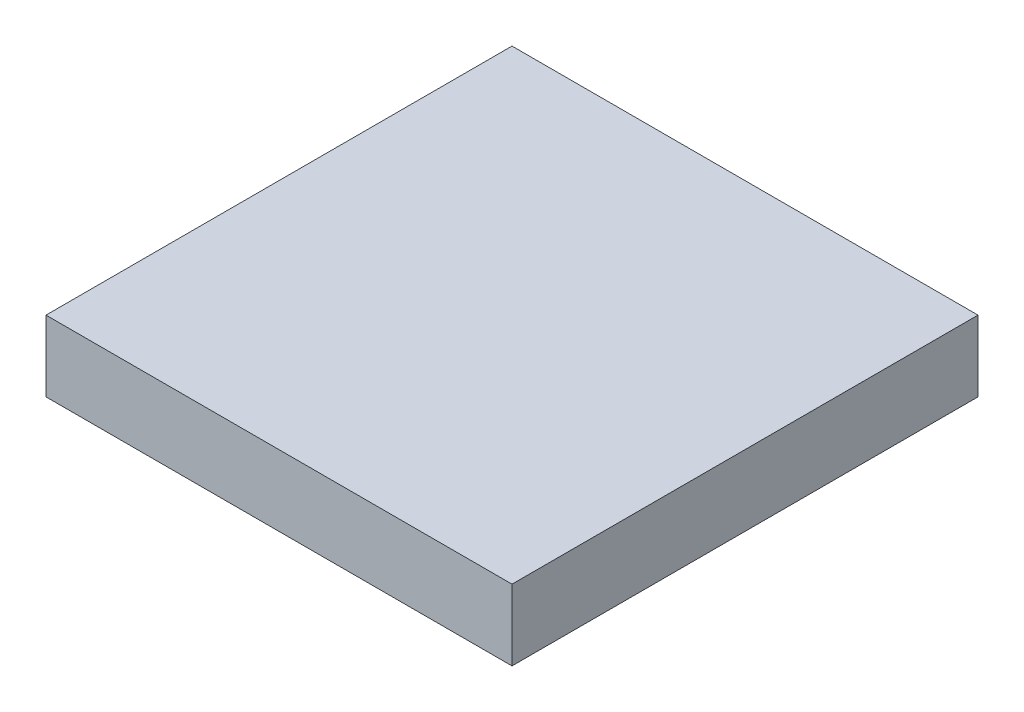
ISO-10303-21;
HEADER;
FILE_DESCRIPTION(('STEP AP214'),'2;1');
FILE_NAME('part.step','',(''),(''),'','','');
FILE_SCHEMA(('AUTOMOTIVE_DESIGN { 1 0 10303 214 1 1 1 1 }'));
ENDSEC;
DATA;
#1=APPLICATION_CONTEXT('core data for automotive mechanical design processes');
#2=APPLICATION_PROTOCOL_DEFINITION('international standard','automotive_design',2000,#1);
#3=PRODUCT_CONTEXT('',#1,'mechanical');
#4=PRODUCT('Part','Part','',(#3));
#5=PRODUCT_RELATED_PRODUCT_CATEGORY('part','',(#4));
#6=PRODUCT_DEFINITION_FORMATION('','',#4);
#7=PRODUCT_DEFINITION_CONTEXT('part definition',#1,'design');
#8=PRODUCT_DEFINITION('design','',#6,#7);
#9=PRODUCT_DEFINITION_SHAPE('','',#8);
#10=(LENGTH_UNIT() NAMED_UNIT(*) SI_UNIT(.MILLI.,.METRE.));
#11=(NAMED_UNIT(*) PLANE_ANGLE_UNIT() SI_UNIT($,.RADIAN.));
#12=(NAMED_UNIT(*) SI_UNIT($,.STERADIAN.) SOLID_ANGLE_UNIT());
#13=UNCERTAINTY_MEASURE_WITH_UNIT(LENGTH_MEASURE(1.E-05),#10,'distance_accuracy_value','');
#14=(GEOMETRIC_REPRESENTATION_CONTEXT(3) GLOBAL_UNCERTAINTY_ASSIGNED_CONTEXT((#13)) GLOBAL_UNIT_ASSIGNED_CONTEXT((#10,
#11,#12)) REPRESENTATION_CONTEXT('',''));
#15=CARTESIAN_POINT('',(0.,0.,0.));
#16=DIRECTION('',(0.,0.,1.));
#17=DIRECTION('',(1.,0.,0.));
#18=AXIS2_PLACEMENT_3D('',#15,#16,#17);
#19=CARTESIAN_POINT('',(4.99999999999997,1.52,-5.));
#20=DIRECTION('',(-1.,0.,0.));
#21=DIRECTION('',(0.,0.,1.));
#22=AXIS2_PLACEMENT_3D('',#19,#20,#21);
#23=PLANE('',#22);
#24=DIRECTION('',(0.,0.,-1.));
#25=VECTOR('',#24,1.);
#26=CARTESIAN_POINT('',(4.99999999999997,0.,-5.));
#27=LINE('',#26,#25);
#28=CARTESIAN_POINT('',(4.99999999999998,0.,5.));
#29=VERTEX_POINT('',#28);
#30=CARTESIAN_POINT('',(4.99999999999997,0.,-5.));
#31=VERTEX_POINT('',#30);
#32=EDGE_CURVE('E101',#29,#31,#27,.T.);
#33=ORIENTED_EDGE('',*,*,#32,.T.);
#34=DIRECTION('',(0.,-1.,0.));
#35=VECTOR('',#34,1.);
#36=CARTESIAN_POINT('',(4.99999999999997,1.52,-5.));
#37=LINE('',#36,#35);
#38=CARTESIAN_POINT('',(4.99999999999997,1.52,-5.));
#39=VERTEX_POINT('',#38);
#40=EDGE_CURVE('E11',#39,#31,#37,.T.);
#41=ORIENTED_EDGE('',*,*,#40,.F.);
#42=DIRECTION('',(0.,0.,-1.));
#43=VECTOR('',#42,1.);
#44=CARTESIAN_POINT('',(4.99999999999997,1.52,-5.));
#45=LINE('',#44,#43);
#46=CARTESIAN_POINT('',(4.99999999999998,1.52,5.));
#47=VERTEX_POINT('',#46);
#48=EDGE_CURVE('E89',#47,#39,#45,.T.);
#49=ORIENTED_EDGE('',*,*,#48,.F.);
#50=DIRECTION('',(0.,-1.,0.));
#51=VECTOR('',#50,1.);
#52=CARTESIAN_POINT('',(4.99999999999998,1.52,5.));
#53=LINE('',#52,#51);
#54=EDGE_CURVE('E97',#47,#29,#53,.T.);
#55=ORIENTED_EDGE('',*,*,#54,.T.);
#56=EDGE_LOOP('',(#33,#41,#49,#55));
#57=FACE_BOUND('',#56,.T.);
#58=ADVANCED_FACE('F38',(#57),#23,.F.);
#59=CARTESIAN_POINT('',(-5.00000000000001,1.52,-5.));
#60=DIRECTION('',(0.,0.,1.));
#61=DIRECTION('',(1.,0.,0.));
#62=AXIS2_PLACEMENT_3D('',#59,#60,#61);
#63=PLANE('',#62);
#64=DIRECTION('',(-1.,0.,0.));
#65=VECTOR('',#64,1.);
#66=CARTESIAN_POINT('',(-5.00000000000001,0.,-5.));
#67=LINE('',#66,#65);
#68=CARTESIAN_POINT('',(-5.00000000000001,0.,-5.));
#69=VERTEX_POINT('',#68);
#70=EDGE_CURVE('E93',#31,#69,#67,.T.);
#71=ORIENTED_EDGE('',*,*,#70,.T.);
#72=DIRECTION('',(0.,-1.,0.));
#73=VECTOR('',#72,1.);
#74=CARTESIAN_POINT('',(-5.00000000000001,1.52,-5.));
#75=LINE('',#74,#73);
#76=CARTESIAN_POINT('',(-5.00000000000001,1.52,-5.));
#77=VERTEX_POINT('',#76);
#78=EDGE_CURVE('E46',#77,#69,#75,.T.);
#79=ORIENTED_EDGE('',*,*,#78,.F.);
#80=DIRECTION('',(-1.,0.,0.));
#81=VECTOR('',#80,1.);
#82=CARTESIAN_POINT('',(-5.00000000000001,1.52,-5.));
#83=LINE('',#82,#81);
#84=EDGE_CURVE('E84',#39,#77,#83,.T.);
#85=ORIENTED_EDGE('',*,*,#84,.F.);
#86=ORIENTED_EDGE('',*,*,#40,.T.);
#87=EDGE_LOOP('',(#71,#79,#85,#86));
#88=FACE_BOUND('',#87,.T.);
#89=ADVANCED_FACE('F92',(#88),#63,.F.);
#90=CARTESIAN_POINT('',(-5.00000000000001,1.52,-5.));
#91=DIRECTION('',(1.,0.,0.));
#92=DIRECTION('',(0.,0.,-1.));
#93=AXIS2_PLACEMENT_3D('',#90,#91,#92);
#94=PLANE('',#93);
#95=DIRECTION('',(0.,0.,1.));
#96=VECTOR('',#95,1.);
#97=CARTESIAN_POINT('',(-5.00000000000001,0.,-5.));
#98=LINE('',#97,#96);
#99=CARTESIAN_POINT('',(-5.00000000000001,0.,5.));
#100=VERTEX_POINT('',#99);
#101=EDGE_CURVE('E71',#69,#100,#98,.T.);
#102=ORIENTED_EDGE('',*,*,#101,.T.);
#103=DIRECTION('',(0.,-1.,0.));
#104=VECTOR('',#103,1.);
#105=CARTESIAN_POINT('',(-5.00000000000001,1.52,5.));
#106=LINE('',#105,#104);
#107=CARTESIAN_POINT('',(-5.00000000000001,1.52,5.));
#108=VERTEX_POINT('',#107);
#109=EDGE_CURVE('E94',#108,#100,#106,.T.);
#110=ORIENTED_EDGE('',*,*,#109,.F.);
#111=DIRECTION('',(0.,0.,1.));
#112=VECTOR('',#111,1.);
#113=CARTESIAN_POINT('',(-5.00000000000001,1.52,-5.));
#114=LINE('',#113,#112);
#115=EDGE_CURVE('E87',#77,#108,#114,.T.);
#116=ORIENTED_EDGE('',*,*,#115,.F.);
#117=ORIENTED_EDGE('',*,*,#78,.T.);
#118=EDGE_LOOP('',(#102,#110,#116,#117));
#119=FACE_BOUND('',#118,.T.);
#120=ADVANCED_FACE('F95',(#119),#94,.F.);
#121=CARTESIAN_POINT('',(-5.00000000000001,1.52,5.));
#122=DIRECTION('',(0.,0.,-1.));
#123=DIRECTION('',(-1.,0.,0.));
#124=AXIS2_PLACEMENT_3D('',#121,#122,#123);
#125=PLANE('',#124);
#126=DIRECTION('',(1.,0.,0.));
#127=VECTOR('',#126,1.);
#128=CARTESIAN_POINT('',(-5.00000000000001,0.,5.));
#129=LINE('',#128,#127);
#130=EDGE_CURVE('E77',#100,#29,#129,.T.);
#131=ORIENTED_EDGE('',*,*,#130,.T.);
#132=ORIENTED_EDGE('',*,*,#54,.F.);
#133=DIRECTION('',(1.,0.,0.));
#134=VECTOR('',#133,1.);
#135=CARTESIAN_POINT('',(-5.00000000000001,1.52,5.));
#136=LINE('',#135,#134);
#137=EDGE_CURVE('E54',#108,#47,#136,.T.);
#138=ORIENTED_EDGE('',*,*,#137,.F.);
#139=ORIENTED_EDGE('',*,*,#109,.T.);
#140=EDGE_LOOP('',(#131,#132,#138,#139));
#141=FACE_BOUND('',#140,.T.);
#142=ADVANCED_FACE('F108',(#141),#125,.F.);
#143=CARTESIAN_POINT('',(0.,1.52,0.));
#144=DIRECTION('',(0.,1.,0.));
#145=DIRECTION('',(0.,0.,1.));
#146=AXIS2_PLACEMENT_3D('',#143,#144,#145);
#147=PLANE('',#146);
#148=ORIENTED_EDGE('',*,*,#48,.T.);
#149=ORIENTED_EDGE('',*,*,#84,.T.);
#150=ORIENTED_EDGE('',*,*,#115,.T.);
#151=ORIENTED_EDGE('',*,*,#137,.T.);
#152=EDGE_LOOP('',(#148,#149,#150,#151));
#153=FACE_BOUND('',#152,.T.);
#154=ADVANCED_FACE('F85',(#153),#147,.T.);
#155=CARTESIAN_POINT('',(0.,0.,0.));
#156=DIRECTION('',(0.,1.,0.));
#157=DIRECTION('',(0.,0.,1.));
#158=AXIS2_PLACEMENT_3D('',#155,#156,#157);
#159=PLANE('',#158);
#160=ORIENTED_EDGE('',*,*,#32,.F.);
#161=ORIENTED_EDGE('',*,*,#130,.F.);
#162=ORIENTED_EDGE('',*,*,#101,.F.);
#163=ORIENTED_EDGE('',*,*,#70,.F.);
#164=EDGE_LOOP('',(#160,#161,#162,#163));
#165=FACE_BOUND('',#164,.T.);
#166=ADVANCED_FACE('F111',(#165),#159,.F.);
#167=CLOSED_SHELL('',(#58,#89,#120,#142,#154,#166));
#168=MANIFOLD_SOLID_BREP('B2',#167);
#169=ADVANCED_BREP_SHAPE_REPRESENTATION('',(#18,#168),#14);
#170=SHAPE_DEFINITION_REPRESENTATION(#9,#169);
ENDSEC;
END-ISO-10303-21;
